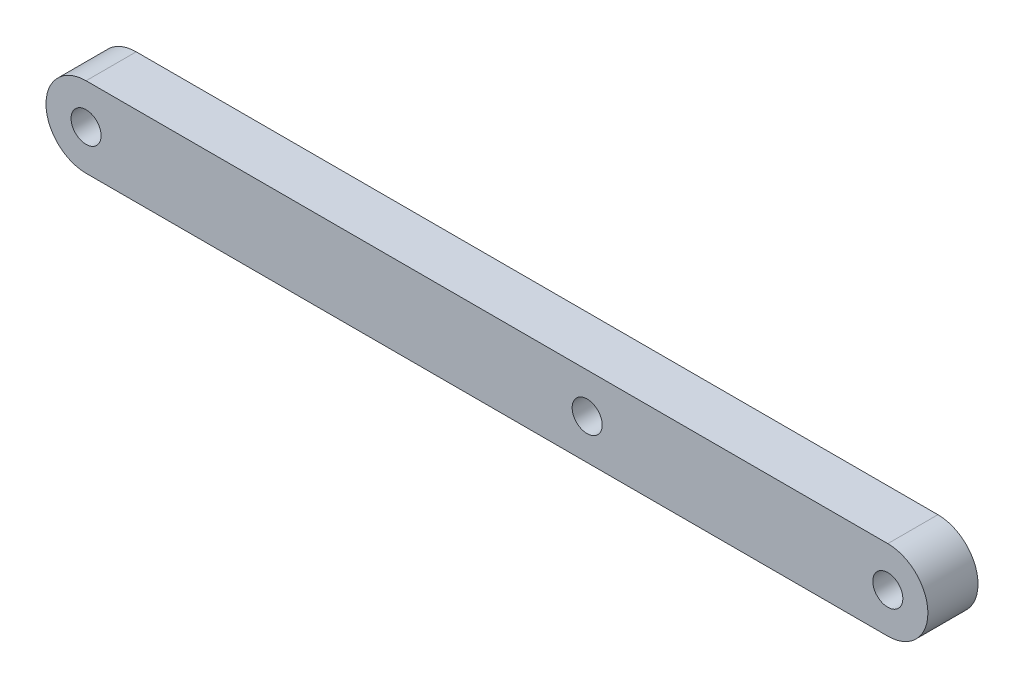
ISO-10303-21;
HEADER;
FILE_DESCRIPTION(('STEP AP214'),'2;1');
FILE_NAME('part.step','',(''),(''),'','','');
FILE_SCHEMA(('AUTOMOTIVE_DESIGN { 1 0 10303 214 1 1 1 1 }'));
ENDSEC;
DATA;
#1=APPLICATION_CONTEXT('core data for automotive mechanical design processes');
#2=APPLICATION_PROTOCOL_DEFINITION('international standard','automotive_design',2000,#1);
#3=PRODUCT_CONTEXT('',#1,'mechanical');
#4=PRODUCT('Part','Part','',(#3));
#5=PRODUCT_RELATED_PRODUCT_CATEGORY('part','',(#4));
#6=PRODUCT_DEFINITION_FORMATION('','',#4);
#7=PRODUCT_DEFINITION_CONTEXT('part definition',#1,'design');
#8=PRODUCT_DEFINITION('design','',#6,#7);
#9=PRODUCT_DEFINITION_SHAPE('','',#8);
#10=(LENGTH_UNIT() NAMED_UNIT(*) SI_UNIT(.MILLI.,.METRE.));
#11=(NAMED_UNIT(*) PLANE_ANGLE_UNIT() SI_UNIT($,.RADIAN.));
#12=(NAMED_UNIT(*) SI_UNIT($,.STERADIAN.) SOLID_ANGLE_UNIT());
#13=UNCERTAINTY_MEASURE_WITH_UNIT(LENGTH_MEASURE(1.E-05),#10,'distance_accuracy_value','');
#14=(GEOMETRIC_REPRESENTATION_CONTEXT(3) GLOBAL_UNCERTAINTY_ASSIGNED_CONTEXT((#13)) GLOBAL_UNIT_ASSIGNED_CONTEXT((#10,
#11,#12)) REPRESENTATION_CONTEXT('',''));
#15=CARTESIAN_POINT('',(0.,0.,0.));
#16=DIRECTION('',(0.,0.,1.));
#17=DIRECTION('',(1.,0.,0.));
#18=AXIS2_PLACEMENT_3D('',#15,#16,#17);
#19=CARTESIAN_POINT('',(-17.9534883720932,-5.,5.));
#20=DIRECTION('',(0.,0.,1.));
#21=DIRECTION('',(1.,0.,0.));
#22=AXIS2_PLACEMENT_3D('',#19,#20,#21);
#23=PLANE('',#22);
#24=CARTESIAN_POINT('',(-47.9534883720932,-5.,5.));
#25=DIRECTION('',(0.,0.,1.));
#26=DIRECTION('',(1.,0.,0.));
#27=AXIS2_PLACEMENT_3D('',#24,#25,#26);
#28=CIRCLE('',#27,1.5);
#29=CARTESIAN_POINT('',(-46.4534883720932,-5.,5.));
#30=VERTEX_POINT('',#29);
#31=EDGE_CURVE('E147',#30,#30,#28,.T.);
#32=ORIENTED_EDGE('',*,*,#31,.F.);
#33=EDGE_LOOP('',(#32));
#34=FACE_BOUND('',#33,.T.);
#35=CARTESIAN_POINT('',(-97.9534883720932,-5.,5.));
#36=DIRECTION('',(0.,0.,1.));
#37=DIRECTION('',(1.,0.,0.));
#38=AXIS2_PLACEMENT_3D('',#35,#36,#37);
#39=CIRCLE('',#38,1.5);
#40=CARTESIAN_POINT('',(-96.4534883720932,-5.,5.));
#41=VERTEX_POINT('',#40);
#42=EDGE_CURVE('E114',#41,#41,#39,.T.);
#43=ORIENTED_EDGE('',*,*,#42,.F.);
#44=EDGE_LOOP('',(#43));
#45=FACE_BOUND('',#44,.T.);
#46=CARTESIAN_POINT('',(-17.9534883720932,-5.,5.));
#47=DIRECTION('',(0.,0.,1.));
#48=DIRECTION('',(1.,0.,0.));
#49=AXIS2_PLACEMENT_3D('',#46,#47,#48);
#50=CIRCLE('',#49,4.00000000000013);
#51=CARTESIAN_POINT('',(-17.9534877335575,-9.,5.));
#52=VERTEX_POINT('',#51);
#53=CARTESIAN_POINT('',(-17.9534870556959,-0.999999999999999,5.));
#54=VERTEX_POINT('',#53);
#55=EDGE_CURVE('E93',#52,#54,#50,.T.);
#56=ORIENTED_EDGE('',*,*,#55,.T.);
#57=DIRECTION('',(-1.,0.,0.));
#58=VECTOR('',#57,1.);
#59=CARTESIAN_POINT('',(-97.9534883720932,-0.999999999999999,5.));
#60=LINE('',#59,#58);
#61=CARTESIAN_POINT('',(-97.9534883720932,-0.999999999999999,5.));
#62=VERTEX_POINT('',#61);
#63=EDGE_CURVE('E88',#54,#62,#60,.T.);
#64=ORIENTED_EDGE('',*,*,#63,.T.);
#65=CARTESIAN_POINT('',(-97.9534883720932,-5.,5.));
#66=DIRECTION('',(0.,0.,1.));
#67=DIRECTION('',(1.,0.,0.));
#68=AXIS2_PLACEMENT_3D('',#65,#66,#67);
#69=CIRCLE('',#68,4.);
#70=CARTESIAN_POINT('',(-97.9534883720932,-9.,5.));
#71=VERTEX_POINT('',#70);
#72=EDGE_CURVE('E91',#62,#71,#69,.T.);
#73=ORIENTED_EDGE('',*,*,#72,.T.);
#74=DIRECTION('',(1.,0.,0.));
#75=VECTOR('',#74,1.);
#76=CARTESIAN_POINT('',(-97.9534883720932,-9.,5.));
#77=LINE('',#76,#75);
#78=EDGE_CURVE('E58',#71,#52,#77,.T.);
#79=ORIENTED_EDGE('',*,*,#78,.T.);
#80=EDGE_LOOP('',(#56,#64,#73,#79));
#81=FACE_BOUND('',#80,.T.);
#82=CARTESIAN_POINT('',(-17.9534883720932,-5.,5.));
#83=DIRECTION('',(0.,0.,1.));
#84=DIRECTION('',(1.,0.,0.));
#85=AXIS2_PLACEMENT_3D('',#82,#83,#84);
#86=CIRCLE('',#85,1.5);
#87=CARTESIAN_POINT('',(-16.4534883720932,-5.,5.));
#88=VERTEX_POINT('',#87);
#89=EDGE_CURVE('E136',#88,#88,#86,.T.);
#90=ORIENTED_EDGE('',*,*,#89,.F.);
#91=EDGE_LOOP('',(#90));
#92=FACE_BOUND('',#91,.T.);
#93=ADVANCED_FACE('F39',(#34,#45,#81,#92),#23,.T.);
#94=CARTESIAN_POINT('',(-17.9534883720932,-5.,0.));
#95=DIRECTION('',(0.,0.,1.));
#96=DIRECTION('',(1.,0.,0.));
#97=AXIS2_PLACEMENT_3D('',#94,#95,#96);
#98=PLANE('',#97);
#99=CARTESIAN_POINT('',(-47.9534883720932,-5.,0.));
#100=DIRECTION('',(0.,0.,1.));
#101=DIRECTION('',(1.,0.,0.));
#102=AXIS2_PLACEMENT_3D('',#99,#100,#101);
#103=CIRCLE('',#102,1.5);
#104=CARTESIAN_POINT('',(-46.4534883720932,-5.,0.));
#105=VERTEX_POINT('',#104);
#106=EDGE_CURVE('E43',#105,#105,#103,.T.);
#107=ORIENTED_EDGE('',*,*,#106,.T.);
#108=EDGE_LOOP('',(#107));
#109=FACE_BOUND('',#108,.T.);
#110=CARTESIAN_POINT('',(-17.9534883720932,-5.,0.));
#111=DIRECTION('',(0.,0.,1.));
#112=DIRECTION('',(1.,0.,0.));
#113=AXIS2_PLACEMENT_3D('',#110,#111,#112);
#114=CIRCLE('',#113,4.00000000000013);
#115=CARTESIAN_POINT('',(-17.9534877335575,-9.,0.));
#116=VERTEX_POINT('',#115);
#117=CARTESIAN_POINT('',(-17.9534870556959,-0.999999999999999,0.));
#118=VERTEX_POINT('',#117);
#119=EDGE_CURVE('E110',#116,#118,#114,.T.);
#120=ORIENTED_EDGE('',*,*,#119,.F.);
#121=DIRECTION('',(1.,0.,0.));
#122=VECTOR('',#121,1.);
#123=CARTESIAN_POINT('',(-97.9534883720932,-9.,0.));
#124=LINE('',#123,#122);
#125=CARTESIAN_POINT('',(-97.9534883720932,-9.,0.));
#126=VERTEX_POINT('',#125);
#127=EDGE_CURVE('E81',#126,#116,#124,.T.);
#128=ORIENTED_EDGE('',*,*,#127,.F.);
#129=CARTESIAN_POINT('',(-97.9534883720932,-5.,0.));
#130=DIRECTION('',(0.,0.,1.));
#131=DIRECTION('',(1.,0.,0.));
#132=AXIS2_PLACEMENT_3D('',#129,#130,#131);
#133=CIRCLE('',#132,4.);
#134=CARTESIAN_POINT('',(-97.9534883720932,-0.999999999999999,0.));
#135=VERTEX_POINT('',#134);
#136=EDGE_CURVE('E75',#135,#126,#133,.T.);
#137=ORIENTED_EDGE('',*,*,#136,.F.);
#138=DIRECTION('',(-1.,0.,0.));
#139=VECTOR('',#138,1.);
#140=CARTESIAN_POINT('',(-97.9534883720932,-0.999999999999999,0.));
#141=LINE('',#140,#139);
#142=EDGE_CURVE('E98',#118,#135,#141,.T.);
#143=ORIENTED_EDGE('',*,*,#142,.F.);
#144=EDGE_LOOP('',(#120,#128,#137,#143));
#145=FACE_BOUND('',#144,.T.);
#146=CARTESIAN_POINT('',(-97.9534883720932,-5.,0.));
#147=DIRECTION('',(0.,0.,1.));
#148=DIRECTION('',(1.,0.,0.));
#149=AXIS2_PLACEMENT_3D('',#146,#147,#148);
#150=CIRCLE('',#149,1.5);
#151=CARTESIAN_POINT('',(-96.4534883720932,-5.,0.));
#152=VERTEX_POINT('',#151);
#153=EDGE_CURVE('E132',#152,#152,#150,.T.);
#154=ORIENTED_EDGE('',*,*,#153,.T.);
#155=EDGE_LOOP('',(#154));
#156=FACE_BOUND('',#155,.T.);
#157=CARTESIAN_POINT('',(-17.9534883720932,-5.,0.));
#158=DIRECTION('',(0.,0.,1.));
#159=DIRECTION('',(1.,0.,0.));
#160=AXIS2_PLACEMENT_3D('',#157,#158,#159);
#161=CIRCLE('',#160,1.5);
#162=CARTESIAN_POINT('',(-16.4534883720932,-5.,0.));
#163=VERTEX_POINT('',#162);
#164=EDGE_CURVE('E140',#163,#163,#161,.T.);
#165=ORIENTED_EDGE('',*,*,#164,.T.);
#166=EDGE_LOOP('',(#165));
#167=FACE_BOUND('',#166,.T.);
#168=ADVANCED_FACE('F127',(#109,#145,#156,#167),#98,.F.);
#169=CARTESIAN_POINT('',(-17.9534883720932,-5.,5.));
#170=DIRECTION('',(0.,0.,-1.));
#171=DIRECTION('',(-1.,0.,0.));
#172=AXIS2_PLACEMENT_3D('',#169,#170,#171);
#173=CYLINDRICAL_SURFACE('',#172,4.00000000000013);
#174=ORIENTED_EDGE('',*,*,#119,.T.);
#175=DIRECTION('',(0.,0.,-1.));
#176=VECTOR('',#175,1.);
#177=CARTESIAN_POINT('',(-17.9534870556959,-0.999999999999999,5.));
#178=LINE('',#177,#176);
#179=EDGE_CURVE('E11',#54,#118,#178,.T.);
#180=ORIENTED_EDGE('',*,*,#179,.F.);
#181=ORIENTED_EDGE('',*,*,#55,.F.);
#182=DIRECTION('',(0.,0.,-1.));
#183=VECTOR('',#182,1.);
#184=CARTESIAN_POINT('',(-17.9534877335575,-9.,5.));
#185=LINE('',#184,#183);
#186=EDGE_CURVE('E106',#52,#116,#185,.T.);
#187=ORIENTED_EDGE('',*,*,#186,.T.);
#188=EDGE_LOOP('',(#174,#180,#181,#187));
#189=FACE_BOUND('',#188,.T.);
#190=ADVANCED_FACE('F41',(#189),#173,.T.);
#191=CARTESIAN_POINT('',(-97.9534883720932,-0.999999999999999,5.));
#192=DIRECTION('',(0.,-1.,0.));
#193=DIRECTION('',(0.,0.,-1.));
#194=AXIS2_PLACEMENT_3D('',#191,#192,#193);
#195=PLANE('',#194);
#196=ORIENTED_EDGE('',*,*,#142,.T.);
#197=DIRECTION('',(0.,0.,-1.));
#198=VECTOR('',#197,1.);
#199=CARTESIAN_POINT('',(-97.9534883720932,-0.999999999999999,5.));
#200=LINE('',#199,#198);
#201=EDGE_CURVE('E50',#62,#135,#200,.T.);
#202=ORIENTED_EDGE('',*,*,#201,.F.);
#203=ORIENTED_EDGE('',*,*,#63,.F.);
#204=ORIENTED_EDGE('',*,*,#179,.T.);
#205=EDGE_LOOP('',(#196,#202,#203,#204));
#206=FACE_BOUND('',#205,.T.);
#207=ADVANCED_FACE('F97',(#206),#195,.F.);
#208=CARTESIAN_POINT('',(-97.9534883720932,-5.,5.));
#209=DIRECTION('',(0.,0.,-1.));
#210=DIRECTION('',(-1.,0.,0.));
#211=AXIS2_PLACEMENT_3D('',#208,#209,#210);
#212=CYLINDRICAL_SURFACE('',#211,4.);
#213=ORIENTED_EDGE('',*,*,#136,.T.);
#214=DIRECTION('',(0.,0.,-1.));
#215=VECTOR('',#214,1.);
#216=CARTESIAN_POINT('',(-97.9534883720932,-9.,5.));
#217=LINE('',#216,#215);
#218=EDGE_CURVE('E100',#71,#126,#217,.T.);
#219=ORIENTED_EDGE('',*,*,#218,.F.);
#220=ORIENTED_EDGE('',*,*,#72,.F.);
#221=ORIENTED_EDGE('',*,*,#201,.T.);
#222=EDGE_LOOP('',(#213,#219,#220,#221));
#223=FACE_BOUND('',#222,.T.);
#224=ADVANCED_FACE('F102',(#223),#212,.T.);
#225=CARTESIAN_POINT('',(-97.9534883720932,-9.,5.));
#226=DIRECTION('',(0.,1.,0.));
#227=DIRECTION('',(0.,0.,1.));
#228=AXIS2_PLACEMENT_3D('',#225,#226,#227);
#229=PLANE('',#228);
#230=ORIENTED_EDGE('',*,*,#127,.T.);
#231=ORIENTED_EDGE('',*,*,#186,.F.);
#232=ORIENTED_EDGE('',*,*,#78,.F.);
#233=ORIENTED_EDGE('',*,*,#218,.T.);
#234=EDGE_LOOP('',(#230,#231,#232,#233));
#235=FACE_BOUND('',#234,.T.);
#236=ADVANCED_FACE('F124',(#235),#229,.F.);
#237=CARTESIAN_POINT('',(-97.9534883720932,-5.,5.));
#238=DIRECTION('',(0.,0.,-1.));
#239=DIRECTION('',(-1.,0.,0.));
#240=AXIS2_PLACEMENT_3D('',#237,#238,#239);
#241=CYLINDRICAL_SURFACE('',#240,1.5);
#242=ORIENTED_EDGE('',*,*,#42,.T.);
#243=EDGE_LOOP('',(#242));
#244=FACE_BOUND('',#243,.T.);
#245=ORIENTED_EDGE('',*,*,#153,.F.);
#246=EDGE_LOOP('',(#245));
#247=FACE_BOUND('',#246,.T.);
#248=ADVANCED_FACE('F164',(#244,#247),#241,.F.);
#249=CARTESIAN_POINT('',(-17.9534883720932,-5.,5.));
#250=DIRECTION('',(0.,0.,-1.));
#251=DIRECTION('',(-1.,0.,0.));
#252=AXIS2_PLACEMENT_3D('',#249,#250,#251);
#253=CYLINDRICAL_SURFACE('',#252,1.5);
#254=ORIENTED_EDGE('',*,*,#89,.T.);
#255=EDGE_LOOP('',(#254));
#256=FACE_BOUND('',#255,.T.);
#257=ORIENTED_EDGE('',*,*,#164,.F.);
#258=EDGE_LOOP('',(#257));
#259=FACE_BOUND('',#258,.T.);
#260=ADVANCED_FACE('F159',(#256,#259),#253,.F.);
#261=CARTESIAN_POINT('',(-47.9534883720932,-5.,-5.));
#262=DIRECTION('',(0.,0.,1.));
#263=DIRECTION('',(1.,0.,0.));
#264=AXIS2_PLACEMENT_3D('',#261,#262,#263);
#265=CYLINDRICAL_SURFACE('',#264,1.5);
#266=ORIENTED_EDGE('',*,*,#31,.T.);
#267=EDGE_LOOP('',(#266));
#268=FACE_BOUND('',#267,.T.);
#269=ORIENTED_EDGE('',*,*,#106,.F.);
#270=EDGE_LOOP('',(#269));
#271=FACE_BOUND('',#270,.T.);
#272=ADVANCED_FACE('F157',(#268,#271),#265,.F.);
#273=CLOSED_SHELL('',(#93,#168,#190,#207,#224,#236,#248,#260,#272));
#274=MANIFOLD_SOLID_BREP('B2',#273);
#275=ADVANCED_BREP_SHAPE_REPRESENTATION('',(#18,#274),#14);
#276=SHAPE_DEFINITION_REPRESENTATION(#9,#275);
ENDSEC;
END-ISO-10303-21;
